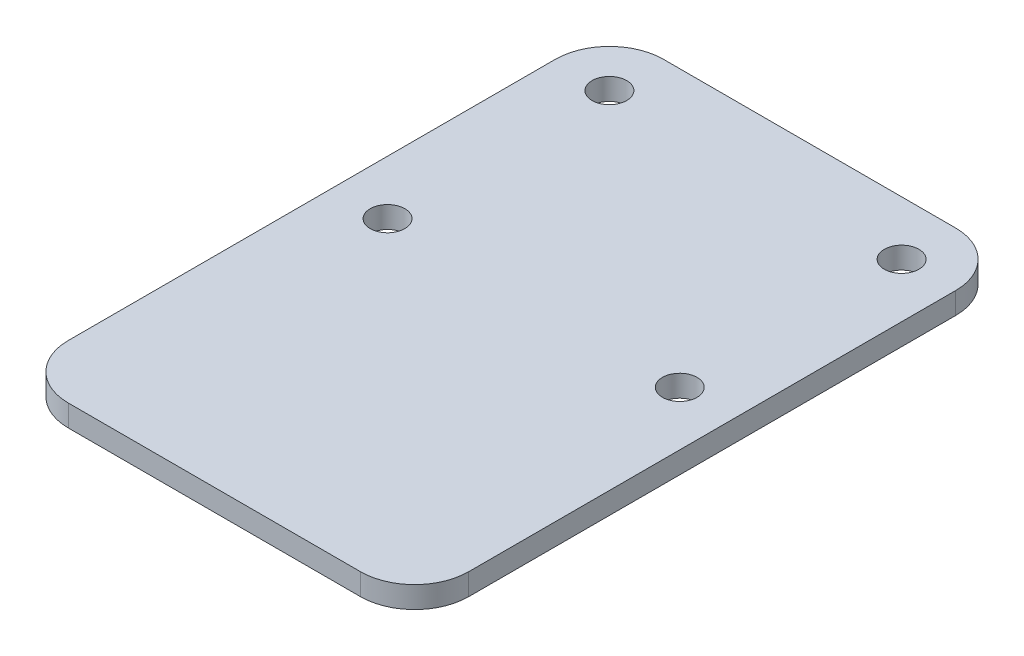
ISO-10303-21;
HEADER;
FILE_DESCRIPTION(('STEP AP214'),'2;1');
FILE_NAME('part.step','',(''),(''),'','','');
FILE_SCHEMA(('AUTOMOTIVE_DESIGN { 1 0 10303 214 1 1 1 1 }'));
ENDSEC;
DATA;
#1=APPLICATION_CONTEXT('core data for automotive mechanical design processes');
#2=APPLICATION_PROTOCOL_DEFINITION('international standard','automotive_design',2000,#1);
#3=PRODUCT_CONTEXT('',#1,'mechanical');
#4=PRODUCT('Part','Part','',(#3));
#5=PRODUCT_RELATED_PRODUCT_CATEGORY('part','',(#4));
#6=PRODUCT_DEFINITION_FORMATION('','',#4);
#7=PRODUCT_DEFINITION_CONTEXT('part definition',#1,'design');
#8=PRODUCT_DEFINITION('design','',#6,#7);
#9=PRODUCT_DEFINITION_SHAPE('','',#8);
#10=(LENGTH_UNIT() NAMED_UNIT(*) SI_UNIT(.MILLI.,.METRE.));
#11=(NAMED_UNIT(*) PLANE_ANGLE_UNIT() SI_UNIT($,.RADIAN.));
#12=(NAMED_UNIT(*) SI_UNIT($,.STERADIAN.) SOLID_ANGLE_UNIT());
#13=UNCERTAINTY_MEASURE_WITH_UNIT(LENGTH_MEASURE(1.E-05),#10,'distance_accuracy_value','');
#14=(GEOMETRIC_REPRESENTATION_CONTEXT(3) GLOBAL_UNCERTAINTY_ASSIGNED_CONTEXT((#13)) GLOBAL_UNIT_ASSIGNED_CONTEXT((#10,
#11,#12)) REPRESENTATION_CONTEXT('',''));
#15=CARTESIAN_POINT('',(0.,0.,0.));
#16=DIRECTION('',(0.,0.,1.));
#17=DIRECTION('',(1.,0.,0.));
#18=AXIS2_PLACEMENT_3D('',#15,#16,#17);
#19=CARTESIAN_POINT('',(0.,2.,0.));
#20=DIRECTION('',(0.,-1.,0.));
#21=DIRECTION('',(0.,0.,-1.));
#22=AXIS2_PLACEMENT_3D('',#19,#20,#21);
#23=PLANE('',#22);
#24=DIRECTION('',(0.,0.,-1.));
#25=VECTOR('',#24,1.);
#26=CARTESIAN_POINT('',(18.5,2.,27.5));
#27=LINE('',#26,#25);
#28=CARTESIAN_POINT('',(18.5,2.,22.5));
#29=VERTEX_POINT('',#28);
#30=CARTESIAN_POINT('',(18.5,2.,-22.5));
#31=VERTEX_POINT('',#30);
#32=EDGE_CURVE('E150',#29,#31,#27,.T.);
#33=ORIENTED_EDGE('',*,*,#32,.T.);
#34=CARTESIAN_POINT('',(13.5,2.,-22.5));
#35=DIRECTION('',(0.,-1.,0.));
#36=DIRECTION('',(0.,0.,-1.));
#37=AXIS2_PLACEMENT_3D('',#34,#35,#36);
#38=CIRCLE('',#37,5.);
#39=CARTESIAN_POINT('',(13.5,2.,-27.5));
#40=VERTEX_POINT('',#39);
#41=EDGE_CURVE('E174',#31,#40,#38,.F.);
#42=ORIENTED_EDGE('',*,*,#41,.T.);
#43=DIRECTION('',(-1.,0.,0.));
#44=VECTOR('',#43,1.);
#45=CARTESIAN_POINT('',(-18.5,2.,-27.5));
#46=LINE('',#45,#44);
#47=CARTESIAN_POINT('',(-13.5,2.,-27.5));
#48=VERTEX_POINT('',#47);
#49=EDGE_CURVE('E127',#40,#48,#46,.T.);
#50=ORIENTED_EDGE('',*,*,#49,.T.);
#51=CARTESIAN_POINT('',(-13.5,2.,-22.5));
#52=DIRECTION('',(0.,-1.,0.));
#53=DIRECTION('',(0.,0.,-1.));
#54=AXIS2_PLACEMENT_3D('',#51,#52,#53);
#55=CIRCLE('',#54,5.);
#56=CARTESIAN_POINT('',(-18.5,2.,-22.5));
#57=VERTEX_POINT('',#56);
#58=EDGE_CURVE('E171',#48,#57,#55,.F.);
#59=ORIENTED_EDGE('',*,*,#58,.T.);
#60=DIRECTION('',(0.,0.,1.));
#61=VECTOR('',#60,1.);
#62=CARTESIAN_POINT('',(-18.5,2.,27.5));
#63=LINE('',#62,#61);
#64=CARTESIAN_POINT('',(-18.5,2.,22.5));
#65=VERTEX_POINT('',#64);
#66=EDGE_CURVE('E186',#57,#65,#63,.T.);
#67=ORIENTED_EDGE('',*,*,#66,.T.);
#68=CARTESIAN_POINT('',(-13.5,2.,22.5));
#69=DIRECTION('',(0.,-1.,0.));
#70=DIRECTION('',(0.,0.,-1.));
#71=AXIS2_PLACEMENT_3D('',#68,#69,#70);
#72=CIRCLE('',#71,5.);
#73=CARTESIAN_POINT('',(-13.5,2.,27.5));
#74=VERTEX_POINT('',#73);
#75=EDGE_CURVE('E61',#65,#74,#72,.F.);
#76=ORIENTED_EDGE('',*,*,#75,.T.);
#77=DIRECTION('',(1.,0.,0.));
#78=VECTOR('',#77,1.);
#79=CARTESIAN_POINT('',(-18.5,2.,27.5));
#80=LINE('',#79,#78);
#81=CARTESIAN_POINT('',(13.5,2.,27.5));
#82=VERTEX_POINT('',#81);
#83=EDGE_CURVE('E152',#74,#82,#80,.T.);
#84=ORIENTED_EDGE('',*,*,#83,.T.);
#85=CARTESIAN_POINT('',(13.5,2.,22.5));
#86=DIRECTION('',(0.,-1.,0.));
#87=DIRECTION('',(0.,0.,-1.));
#88=AXIS2_PLACEMENT_3D('',#85,#86,#87);
#89=CIRCLE('',#88,5.);
#90=EDGE_CURVE('E166',#82,#29,#89,.F.);
#91=ORIENTED_EDGE('',*,*,#90,.T.);
#92=EDGE_LOOP('',(#33,#42,#50,#59,#67,#76,#84,#91));
#93=FACE_BOUND('',#92,.T.);
#94=CARTESIAN_POINT('',(-13.5,2.,-22.5));
#95=DIRECTION('',(0.,1.,0.));
#96=DIRECTION('',(0.,0.,1.));
#97=AXIS2_PLACEMENT_3D('',#94,#95,#96);
#98=CIRCLE('',#97,1.6);
#99=CARTESIAN_POINT('',(-13.5,2.,-20.9));
#100=VERTEX_POINT('',#99);
#101=EDGE_CURVE('E144',#100,#100,#98,.T.);
#102=ORIENTED_EDGE('',*,*,#101,.F.);
#103=EDGE_LOOP('',(#102));
#104=FACE_BOUND('',#103,.T.);
#105=CARTESIAN_POINT('',(-13.5,2.,-1.99999999999999));
#106=DIRECTION('',(0.,1.,0.));
#107=DIRECTION('',(0.,0.,1.));
#108=AXIS2_PLACEMENT_3D('',#105,#106,#107);
#109=CIRCLE('',#108,1.6);
#110=CARTESIAN_POINT('',(-13.5,2.,-0.399999999999995));
#111=VERTEX_POINT('',#110);
#112=EDGE_CURVE('E199',#111,#111,#109,.T.);
#113=ORIENTED_EDGE('',*,*,#112,.F.);
#114=EDGE_LOOP('',(#113));
#115=FACE_BOUND('',#114,.T.);
#116=CARTESIAN_POINT('',(13.5,2.,-1.99999999999999));
#117=DIRECTION('',(0.,1.,0.));
#118=DIRECTION('',(0.,0.,-1.));
#119=AXIS2_PLACEMENT_3D('',#116,#117,#118);
#120=CIRCLE('',#119,1.6);
#121=CARTESIAN_POINT('',(13.5,2.,-3.59999999999999));
#122=VERTEX_POINT('',#121);
#123=EDGE_CURVE('E207',#122,#122,#120,.T.);
#124=ORIENTED_EDGE('',*,*,#123,.F.);
#125=EDGE_LOOP('',(#124));
#126=FACE_BOUND('',#125,.T.);
#127=CARTESIAN_POINT('',(13.5,2.,-22.5));
#128=DIRECTION('',(0.,1.,0.));
#129=DIRECTION('',(0.,0.,-1.));
#130=AXIS2_PLACEMENT_3D('',#127,#128,#129);
#131=CIRCLE('',#130,1.6);
#132=CARTESIAN_POINT('',(13.5,2.,-24.1));
#133=VERTEX_POINT('',#132);
#134=EDGE_CURVE('E215',#133,#133,#131,.T.);
#135=ORIENTED_EDGE('',*,*,#134,.F.);
#136=EDGE_LOOP('',(#135));
#137=FACE_BOUND('',#136,.T.);
#138=ADVANCED_FACE('F39',(#93,#104,#115,#126,#137),#23,.F.);
#139=CARTESIAN_POINT('',(0.,0.,0.));
#140=DIRECTION('',(0.,-1.,0.));
#141=DIRECTION('',(0.,0.,-1.));
#142=AXIS2_PLACEMENT_3D('',#139,#140,#141);
#143=PLANE('',#142);
#144=CARTESIAN_POINT('',(13.5,0.,-1.99999999999999));
#145=DIRECTION('',(0.,1.,0.));
#146=DIRECTION('',(0.,0.,-1.));
#147=AXIS2_PLACEMENT_3D('',#144,#145,#146);
#148=CIRCLE('',#147,1.6);
#149=CARTESIAN_POINT('',(13.5,0.,-3.59999999999999));
#150=VERTEX_POINT('',#149);
#151=EDGE_CURVE('E211',#150,#150,#148,.T.);
#152=ORIENTED_EDGE('',*,*,#151,.T.);
#153=EDGE_LOOP('',(#152));
#154=FACE_BOUND('',#153,.T.);
#155=CARTESIAN_POINT('',(-13.5,0.,-22.5));
#156=DIRECTION('',(0.,1.,0.));
#157=DIRECTION('',(0.,0.,1.));
#158=AXIS2_PLACEMENT_3D('',#155,#156,#157);
#159=CIRCLE('',#158,1.6);
#160=CARTESIAN_POINT('',(-13.5,0.,-20.9));
#161=VERTEX_POINT('',#160);
#162=EDGE_CURVE('E195',#161,#161,#159,.T.);
#163=ORIENTED_EDGE('',*,*,#162,.T.);
#164=EDGE_LOOP('',(#163));
#165=FACE_BOUND('',#164,.T.);
#166=DIRECTION('',(-1.,0.,0.));
#167=VECTOR('',#166,1.);
#168=CARTESIAN_POINT('',(-18.5,0.,-27.5));
#169=LINE('',#168,#167);
#170=CARTESIAN_POINT('',(13.5,0.,-27.5));
#171=VERTEX_POINT('',#170);
#172=CARTESIAN_POINT('',(-13.5,0.,-27.5));
#173=VERTEX_POINT('',#172);
#174=EDGE_CURVE('E124',#171,#173,#169,.T.);
#175=ORIENTED_EDGE('',*,*,#174,.F.);
#176=CARTESIAN_POINT('',(13.5,0.,-22.5));
#177=DIRECTION('',(0.,-1.,0.));
#178=DIRECTION('',(0.,0.,-1.));
#179=AXIS2_PLACEMENT_3D('',#176,#177,#178);
#180=CIRCLE('',#179,5.);
#181=CARTESIAN_POINT('',(18.5,0.,-22.5));
#182=VERTEX_POINT('',#181);
#183=EDGE_CURVE('E106',#171,#182,#180,.T.);
#184=ORIENTED_EDGE('',*,*,#183,.T.);
#185=DIRECTION('',(0.,0.,-1.));
#186=VECTOR('',#185,1.);
#187=CARTESIAN_POINT('',(18.5,0.,27.5));
#188=LINE('',#187,#186);
#189=CARTESIAN_POINT('',(18.5,0.,22.5));
#190=VERTEX_POINT('',#189);
#191=EDGE_CURVE('E137',#190,#182,#188,.T.);
#192=ORIENTED_EDGE('',*,*,#191,.F.);
#193=CARTESIAN_POINT('',(13.5,0.,22.5));
#194=DIRECTION('',(0.,-1.,0.));
#195=DIRECTION('',(0.,0.,-1.));
#196=AXIS2_PLACEMENT_3D('',#193,#194,#195);
#197=CIRCLE('',#196,5.);
#198=CARTESIAN_POINT('',(13.5,0.,27.5));
#199=VERTEX_POINT('',#198);
#200=EDGE_CURVE('E129',#190,#199,#197,.T.);
#201=ORIENTED_EDGE('',*,*,#200,.T.);
#202=DIRECTION('',(1.,0.,0.));
#203=VECTOR('',#202,1.);
#204=CARTESIAN_POINT('',(-18.5,0.,27.5));
#205=LINE('',#204,#203);
#206=CARTESIAN_POINT('',(-13.5,0.,27.5));
#207=VERTEX_POINT('',#206);
#208=EDGE_CURVE('E142',#207,#199,#205,.T.);
#209=ORIENTED_EDGE('',*,*,#208,.F.);
#210=CARTESIAN_POINT('',(-13.5,0.,22.5));
#211=DIRECTION('',(0.,-1.,0.));
#212=DIRECTION('',(0.,0.,-1.));
#213=AXIS2_PLACEMENT_3D('',#210,#211,#212);
#214=CIRCLE('',#213,5.);
#215=CARTESIAN_POINT('',(-18.5,0.,22.5));
#216=VERTEX_POINT('',#215);
#217=EDGE_CURVE('E156',#207,#216,#214,.T.);
#218=ORIENTED_EDGE('',*,*,#217,.T.);
#219=DIRECTION('',(0.,0.,1.));
#220=VECTOR('',#219,1.);
#221=CARTESIAN_POINT('',(-18.5,0.,27.5));
#222=LINE('',#221,#220);
#223=CARTESIAN_POINT('',(-18.5,0.,-22.5));
#224=VERTEX_POINT('',#223);
#225=EDGE_CURVE('E136',#224,#216,#222,.T.);
#226=ORIENTED_EDGE('',*,*,#225,.F.);
#227=CARTESIAN_POINT('',(-13.5,0.,-22.5));
#228=DIRECTION('',(0.,-1.,0.));
#229=DIRECTION('',(0.,0.,-1.));
#230=AXIS2_PLACEMENT_3D('',#227,#228,#229);
#231=CIRCLE('',#230,5.);
#232=EDGE_CURVE('E118',#224,#173,#231,.T.);
#233=ORIENTED_EDGE('',*,*,#232,.T.);
#234=EDGE_LOOP('',(#175,#184,#192,#201,#209,#218,#226,#233));
#235=FACE_BOUND('',#234,.T.);
#236=CARTESIAN_POINT('',(-13.5,0.,-1.99999999999999));
#237=DIRECTION('',(0.,1.,0.));
#238=DIRECTION('',(0.,0.,1.));
#239=AXIS2_PLACEMENT_3D('',#236,#237,#238);
#240=CIRCLE('',#239,1.6);
#241=CARTESIAN_POINT('',(-13.5,0.,-0.399999999999995));
#242=VERTEX_POINT('',#241);
#243=EDGE_CURVE('E203',#242,#242,#240,.T.);
#244=ORIENTED_EDGE('',*,*,#243,.T.);
#245=EDGE_LOOP('',(#244));
#246=FACE_BOUND('',#245,.T.);
#247=CARTESIAN_POINT('',(13.5,0.,-22.5));
#248=DIRECTION('',(0.,1.,0.));
#249=DIRECTION('',(0.,0.,-1.));
#250=AXIS2_PLACEMENT_3D('',#247,#248,#249);
#251=CIRCLE('',#250,1.6);
#252=CARTESIAN_POINT('',(13.5,0.,-24.1));
#253=VERTEX_POINT('',#252);
#254=EDGE_CURVE('E219',#253,#253,#251,.T.);
#255=ORIENTED_EDGE('',*,*,#254,.T.);
#256=EDGE_LOOP('',(#255));
#257=FACE_BOUND('',#256,.T.);
#258=ADVANCED_FACE('F132',(#154,#165,#235,#246,#257),#143,.T.);
#259=CARTESIAN_POINT('',(18.5,2.,27.5));
#260=DIRECTION('',(-1.,0.,0.));
#261=DIRECTION('',(0.,0.,1.));
#262=AXIS2_PLACEMENT_3D('',#259,#260,#261);
#263=PLANE('',#262);
#264=ORIENTED_EDGE('',*,*,#191,.T.);
#265=DIRECTION('',(0.,-1.,0.));
#266=VECTOR('',#265,1.);
#267=CARTESIAN_POINT('',(18.5,2.,-22.5));
#268=LINE('',#267,#266);
#269=EDGE_CURVE('E111',#182,#31,#268,.F.);
#270=ORIENTED_EDGE('',*,*,#269,.T.);
#271=ORIENTED_EDGE('',*,*,#32,.F.);
#272=DIRECTION('',(0.,-1.,0.));
#273=VECTOR('',#272,1.);
#274=CARTESIAN_POINT('',(18.5,2.,22.5));
#275=LINE('',#274,#273);
#276=EDGE_CURVE('E117',#29,#190,#275,.T.);
#277=ORIENTED_EDGE('',*,*,#276,.T.);
#278=EDGE_LOOP('',(#264,#270,#271,#277));
#279=FACE_BOUND('',#278,.T.);
#280=ADVANCED_FACE('F235',(#279),#263,.F.);
#281=CARTESIAN_POINT('',(-18.5,2.,-27.5));
#282=DIRECTION('',(0.,0.,1.));
#283=DIRECTION('',(1.,0.,0.));
#284=AXIS2_PLACEMENT_3D('',#281,#282,#283);
#285=PLANE('',#284);
#286=ORIENTED_EDGE('',*,*,#49,.F.);
#287=DIRECTION('',(0.,-1.,0.));
#288=VECTOR('',#287,1.);
#289=CARTESIAN_POINT('',(13.5,2.,-27.5));
#290=LINE('',#289,#288);
#291=EDGE_CURVE('E110',#40,#171,#290,.T.);
#292=ORIENTED_EDGE('',*,*,#291,.T.);
#293=ORIENTED_EDGE('',*,*,#174,.T.);
#294=DIRECTION('',(0.,-1.,0.));
#295=VECTOR('',#294,1.);
#296=CARTESIAN_POINT('',(-13.5,2.,-27.5));
#297=LINE('',#296,#295);
#298=EDGE_CURVE('E130',#173,#48,#297,.F.);
#299=ORIENTED_EDGE('',*,*,#298,.T.);
#300=EDGE_LOOP('',(#286,#292,#293,#299));
#301=FACE_BOUND('',#300,.T.);
#302=ADVANCED_FACE('F123',(#301),#285,.F.);
#303=CARTESIAN_POINT('',(-18.5,2.,27.5));
#304=DIRECTION('',(1.,0.,0.));
#305=DIRECTION('',(0.,0.,-1.));
#306=AXIS2_PLACEMENT_3D('',#303,#304,#305);
#307=PLANE('',#306);
#308=ORIENTED_EDGE('',*,*,#66,.F.);
#309=DIRECTION('',(0.,-1.,0.));
#310=VECTOR('',#309,1.);
#311=CARTESIAN_POINT('',(-18.5,2.,-22.5));
#312=LINE('',#311,#310);
#313=EDGE_CURVE('E180',#57,#224,#312,.T.);
#314=ORIENTED_EDGE('',*,*,#313,.T.);
#315=ORIENTED_EDGE('',*,*,#225,.T.);
#316=DIRECTION('',(0.,-1.,0.));
#317=VECTOR('',#316,1.);
#318=CARTESIAN_POINT('',(-18.5,2.,22.5));
#319=LINE('',#318,#317);
#320=EDGE_CURVE('E177',#216,#65,#319,.F.);
#321=ORIENTED_EDGE('',*,*,#320,.T.);
#322=EDGE_LOOP('',(#308,#314,#315,#321));
#323=FACE_BOUND('',#322,.T.);
#324=ADVANCED_FACE('F246',(#323),#307,.F.);
#325=CARTESIAN_POINT('',(-18.5,2.,27.5));
#326=DIRECTION('',(0.,0.,-1.));
#327=DIRECTION('',(-1.,0.,0.));
#328=AXIS2_PLACEMENT_3D('',#325,#326,#327);
#329=PLANE('',#328);
#330=ORIENTED_EDGE('',*,*,#83,.F.);
#331=DIRECTION('',(0.,-1.,0.));
#332=VECTOR('',#331,1.);
#333=CARTESIAN_POINT('',(-13.5,2.,27.5));
#334=LINE('',#333,#332);
#335=EDGE_CURVE('E11',#74,#207,#334,.T.);
#336=ORIENTED_EDGE('',*,*,#335,.T.);
#337=ORIENTED_EDGE('',*,*,#208,.T.);
#338=DIRECTION('',(0.,-1.,0.));
#339=VECTOR('',#338,1.);
#340=CARTESIAN_POINT('',(13.5,2.,27.5));
#341=LINE('',#340,#339);
#342=EDGE_CURVE('E48',#199,#82,#341,.F.);
#343=ORIENTED_EDGE('',*,*,#342,.T.);
#344=EDGE_LOOP('',(#330,#336,#337,#343));
#345=FACE_BOUND('',#344,.T.);
#346=ADVANCED_FACE('F243',(#345),#329,.F.);
#347=CARTESIAN_POINT('',(-13.5,2.,-22.5));
#348=DIRECTION('',(0.,-1.,0.));
#349=DIRECTION('',(0.,0.,-1.));
#350=AXIS2_PLACEMENT_3D('',#347,#348,#349);
#351=CYLINDRICAL_SURFACE('',#350,1.6);
#352=ORIENTED_EDGE('',*,*,#101,.T.);
#353=EDGE_LOOP('',(#352));
#354=FACE_BOUND('',#353,.T.);
#355=ORIENTED_EDGE('',*,*,#162,.F.);
#356=EDGE_LOOP('',(#355));
#357=FACE_BOUND('',#356,.T.);
#358=ADVANCED_FACE('F240',(#354,#357),#351,.F.);
#359=CARTESIAN_POINT('',(-13.5,2.,-1.99999999999999));
#360=DIRECTION('',(0.,-1.,0.));
#361=DIRECTION('',(0.,0.,-1.));
#362=AXIS2_PLACEMENT_3D('',#359,#360,#361);
#363=CYLINDRICAL_SURFACE('',#362,1.6);
#364=ORIENTED_EDGE('',*,*,#112,.T.);
#365=EDGE_LOOP('',(#364));
#366=FACE_BOUND('',#365,.T.);
#367=ORIENTED_EDGE('',*,*,#243,.F.);
#368=EDGE_LOOP('',(#367));
#369=FACE_BOUND('',#368,.T.);
#370=ADVANCED_FACE('F347',(#366,#369),#363,.F.);
#371=CARTESIAN_POINT('',(13.5,2.,-1.99999999999999));
#372=DIRECTION('',(0.,-1.,0.));
#373=DIRECTION('',(0.,0.,-1.));
#374=AXIS2_PLACEMENT_3D('',#371,#372,#373);
#375=CYLINDRICAL_SURFACE('',#374,1.6);
#376=ORIENTED_EDGE('',*,*,#123,.T.);
#377=EDGE_LOOP('',(#376));
#378=FACE_BOUND('',#377,.T.);
#379=ORIENTED_EDGE('',*,*,#151,.F.);
#380=EDGE_LOOP('',(#379));
#381=FACE_BOUND('',#380,.T.);
#382=ADVANCED_FACE('F338',(#378,#381),#375,.F.);
#383=CARTESIAN_POINT('',(13.5,2.,-22.5));
#384=DIRECTION('',(0.,-1.,0.));
#385=DIRECTION('',(0.,0.,-1.));
#386=AXIS2_PLACEMENT_3D('',#383,#384,#385);
#387=CYLINDRICAL_SURFACE('',#386,1.6);
#388=ORIENTED_EDGE('',*,*,#134,.T.);
#389=EDGE_LOOP('',(#388));
#390=FACE_BOUND('',#389,.T.);
#391=ORIENTED_EDGE('',*,*,#254,.F.);
#392=EDGE_LOOP('',(#391));
#393=FACE_BOUND('',#392,.T.);
#394=ADVANCED_FACE('F227',(#390,#393),#387,.F.);
#395=CARTESIAN_POINT('',(13.5,2.,-22.5));
#396=DIRECTION('',(0.,-1.,0.));
#397=DIRECTION('',(0.,0.,-1.));
#398=AXIS2_PLACEMENT_3D('',#395,#396,#397);
#399=CYLINDRICAL_SURFACE('',#398,5.);
#400=ORIENTED_EDGE('',*,*,#41,.F.);
#401=ORIENTED_EDGE('',*,*,#269,.F.);
#402=ORIENTED_EDGE('',*,*,#183,.F.);
#403=ORIENTED_EDGE('',*,*,#291,.F.);
#404=EDGE_LOOP('',(#400,#401,#402,#403));
#405=FACE_BOUND('',#404,.T.);
#406=ADVANCED_FACE('F109',(#405),#399,.T.);
#407=CARTESIAN_POINT('',(-13.5,2.,-22.5));
#408=DIRECTION('',(0.,-1.,0.));
#409=DIRECTION('',(0.,0.,-1.));
#410=AXIS2_PLACEMENT_3D('',#407,#408,#409);
#411=CYLINDRICAL_SURFACE('',#410,5.);
#412=ORIENTED_EDGE('',*,*,#58,.F.);
#413=ORIENTED_EDGE('',*,*,#298,.F.);
#414=ORIENTED_EDGE('',*,*,#232,.F.);
#415=ORIENTED_EDGE('',*,*,#313,.F.);
#416=EDGE_LOOP('',(#412,#413,#414,#415));
#417=FACE_BOUND('',#416,.T.);
#418=ADVANCED_FACE('F257',(#417),#411,.T.);
#419=CARTESIAN_POINT('',(-13.5,2.,22.5));
#420=DIRECTION('',(0.,-1.,0.));
#421=DIRECTION('',(0.,0.,-1.));
#422=AXIS2_PLACEMENT_3D('',#419,#420,#421);
#423=CYLINDRICAL_SURFACE('',#422,5.);
#424=ORIENTED_EDGE('',*,*,#75,.F.);
#425=ORIENTED_EDGE('',*,*,#320,.F.);
#426=ORIENTED_EDGE('',*,*,#217,.F.);
#427=ORIENTED_EDGE('',*,*,#335,.F.);
#428=EDGE_LOOP('',(#424,#425,#426,#427));
#429=FACE_BOUND('',#428,.T.);
#430=ADVANCED_FACE('F259',(#429),#423,.T.);
#431=CARTESIAN_POINT('',(13.5,2.,22.5));
#432=DIRECTION('',(0.,-1.,0.));
#433=DIRECTION('',(0.,0.,-1.));
#434=AXIS2_PLACEMENT_3D('',#431,#432,#433);
#435=CYLINDRICAL_SURFACE('',#434,5.);
#436=ORIENTED_EDGE('',*,*,#90,.F.);
#437=ORIENTED_EDGE('',*,*,#342,.F.);
#438=ORIENTED_EDGE('',*,*,#200,.F.);
#439=ORIENTED_EDGE('',*,*,#276,.F.);
#440=EDGE_LOOP('',(#436,#437,#438,#439));
#441=FACE_BOUND('',#440,.T.);
#442=ADVANCED_FACE('F41',(#441),#435,.T.);
#443=CLOSED_SHELL('',(#138,#258,#280,#302,#324,#346,#358,#370,#382,#394,#406,#418,#430,#442));
#444=MANIFOLD_SOLID_BREP('B2',#443);
#445=ADVANCED_BREP_SHAPE_REPRESENTATION('',(#18,#444),#14);
#446=SHAPE_DEFINITION_REPRESENTATION(#9,#445);
ENDSEC;
END-ISO-10303-21;
